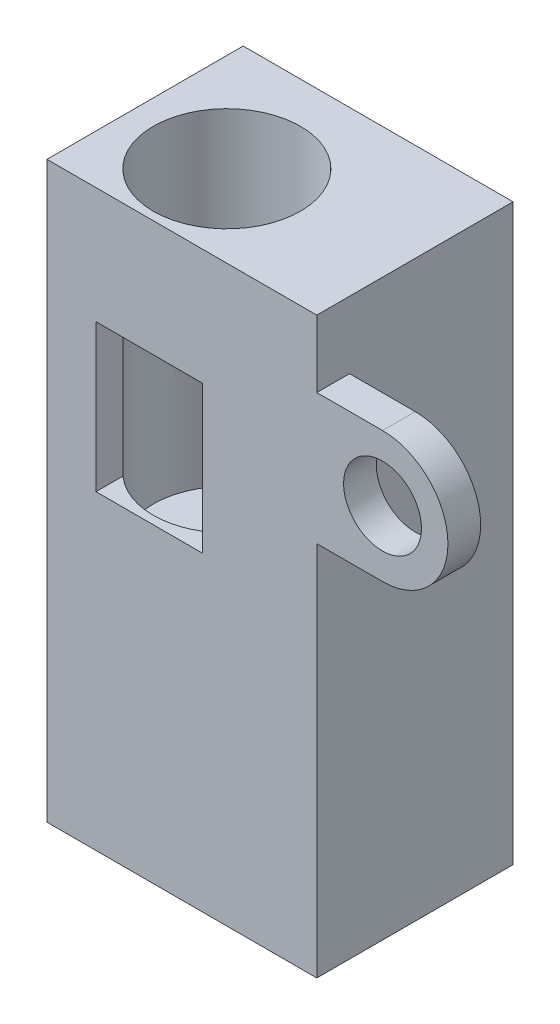
ISO-10303-21;
HEADER;
FILE_DESCRIPTION(('STEP AP214'),'2;1');
FILE_NAME('part.step','',(''),(''),'','','');
FILE_SCHEMA(('AUTOMOTIVE_DESIGN { 1 0 10303 214 1 1 1 1 }'));
ENDSEC;
DATA;
#1=APPLICATION_CONTEXT('core data for automotive mechanical design processes');
#2=APPLICATION_PROTOCOL_DEFINITION('international standard','automotive_design',2000,#1);
#3=PRODUCT_CONTEXT('',#1,'mechanical');
#4=PRODUCT('Part','Part','',(#3));
#5=PRODUCT_RELATED_PRODUCT_CATEGORY('part','',(#4));
#6=PRODUCT_DEFINITION_FORMATION('','',#4);
#7=PRODUCT_DEFINITION_CONTEXT('part definition',#1,'design');
#8=PRODUCT_DEFINITION('design','',#6,#7);
#9=PRODUCT_DEFINITION_SHAPE('','',#8);
#10=(LENGTH_UNIT() NAMED_UNIT(*) SI_UNIT(.MILLI.,.METRE.));
#11=(NAMED_UNIT(*) PLANE_ANGLE_UNIT() SI_UNIT($,.RADIAN.));
#12=(NAMED_UNIT(*) SI_UNIT($,.STERADIAN.) SOLID_ANGLE_UNIT());
#13=UNCERTAINTY_MEASURE_WITH_UNIT(LENGTH_MEASURE(1.E-05),#10,'distance_accuracy_value','');
#14=(GEOMETRIC_REPRESENTATION_CONTEXT(3) GLOBAL_UNCERTAINTY_ASSIGNED_CONTEXT((#13)) GLOBAL_UNIT_ASSIGNED_CONTEXT((#10,
#11,#12)) REPRESENTATION_CONTEXT('',''));
#15=CARTESIAN_POINT('',(0.,0.,0.));
#16=DIRECTION('',(0.,0.,1.));
#17=DIRECTION('',(1.,0.,0.));
#18=AXIS2_PLACEMENT_3D('',#15,#16,#17);
#19=CARTESIAN_POINT('',(16.5,0.,0.));
#20=DIRECTION('',(0.,0.,-1.));
#21=DIRECTION('',(-1.,0.,0.));
#22=AXIS2_PLACEMENT_3D('',#19,#20,#21);
#23=PLANE('',#22);
#24=DIRECTION('',(-1.,0.,0.));
#25=VECTOR('',#24,1.);
#26=CARTESIAN_POINT('',(16.5,37.1,0.));
#27=LINE('',#26,#25);
#28=CARTESIAN_POINT('',(16.5,37.1,0.));
#29=VERTEX_POINT('',#28);
#30=CARTESIAN_POINT('',(0.,37.1,0.));
#31=VERTEX_POINT('',#30);
#32=EDGE_CURVE('E263',#29,#31,#27,.T.);
#33=ORIENTED_EDGE('',*,*,#32,.T.);
#34=DIRECTION('',(0.,-1.,0.));
#35=VECTOR('',#34,1.);
#36=CARTESIAN_POINT('',(0.,0.,0.));
#37=LINE('',#36,#35);
#38=CARTESIAN_POINT('',(0.,2.,0.));
#39=VERTEX_POINT('',#38);
#40=EDGE_CURVE('E258',#31,#39,#37,.T.);
#41=ORIENTED_EDGE('',*,*,#40,.T.);
#42=DIRECTION('',(1.,0.,0.));
#43=VECTOR('',#42,1.);
#44=CARTESIAN_POINT('',(0.,2.,0.));
#45=LINE('',#44,#43);
#46=CARTESIAN_POINT('',(16.5,2.,0.));
#47=VERTEX_POINT('',#46);
#48=EDGE_CURVE('E246',#39,#47,#45,.T.);
#49=ORIENTED_EDGE('',*,*,#48,.T.);
#50=DIRECTION('',(0.,-1.,0.));
#51=VECTOR('',#50,1.);
#52=CARTESIAN_POINT('',(16.5,0.,0.));
#53=LINE('',#52,#51);
#54=CARTESIAN_POINT('',(16.5,25.,0.));
#55=VERTEX_POINT('',#54);
#56=EDGE_CURVE('E257',#55,#47,#53,.T.);
#57=ORIENTED_EDGE('',*,*,#56,.F.);
#58=DIRECTION('',(1.,0.,0.));
#59=VECTOR('',#58,1.);
#60=CARTESIAN_POINT('',(0.,25.,0.));
#61=LINE('',#60,#59);
#62=CARTESIAN_POINT('',(20.5182193377738,25.,0.));
#63=VERTEX_POINT('',#62);
#64=EDGE_CURVE('E203',#55,#63,#61,.T.);
#65=ORIENTED_EDGE('',*,*,#64,.T.);
#66=CARTESIAN_POINT('',(20.5182193377738,29.,0.));
#67=DIRECTION('',(0.,0.,1.));
#68=DIRECTION('',(1.,0.,0.));
#69=AXIS2_PLACEMENT_3D('',#66,#67,#68);
#70=CIRCLE('',#69,4.);
#71=CARTESIAN_POINT('',(20.5182193377738,33.,0.));
#72=VERTEX_POINT('',#71);
#73=EDGE_CURVE('E198',#72,#63,#70,.F.);
#74=ORIENTED_EDGE('',*,*,#73,.F.);
#75=DIRECTION('',(-1.,0.,0.));
#76=VECTOR('',#75,1.);
#77=CARTESIAN_POINT('',(0.,33.,0.));
#78=LINE('',#77,#76);
#79=CARTESIAN_POINT('',(16.5,33.,0.));
#80=VERTEX_POINT('',#79);
#81=EDGE_CURVE('E218',#72,#80,#78,.T.);
#82=ORIENTED_EDGE('',*,*,#81,.T.);
#83=EDGE_CURVE('E259',#29,#80,#53,.T.);
#84=ORIENTED_EDGE('',*,*,#83,.F.);
#85=EDGE_LOOP('',(#33,#41,#49,#57,#65,#74,#82,#84));
#86=FACE_BOUND('',#85,.T.);
#87=CARTESIAN_POINT('',(20.5182193377738,29.,0.));
#88=DIRECTION('',(0.,0.,-1.));
#89=DIRECTION('',(-1.,0.,0.));
#90=AXIS2_PLACEMENT_3D('',#87,#88,#89);
#91=CIRCLE('',#90,2.38125);
#92=CARTESIAN_POINT('',(18.1369693377738,29.,0.));
#93=VERTEX_POINT('',#92);
#94=EDGE_CURVE('E194',#93,#93,#91,.T.);
#95=ORIENTED_EDGE('',*,*,#94,.T.);
#96=EDGE_LOOP('',(#95));
#97=FACE_BOUND('',#96,.T.);
#98=DIRECTION('',(0.,-1.,0.));
#99=VECTOR('',#98,1.);
#100=CARTESIAN_POINT('',(9.5,0.,0.));
#101=LINE('',#100,#99);
#102=CARTESIAN_POINT('',(9.5,30.,0.));
#103=VERTEX_POINT('',#102);
#104=CARTESIAN_POINT('',(9.5,21.,0.));
#105=VERTEX_POINT('',#104);
#106=EDGE_CURVE('E57',#103,#105,#101,.T.);
#107=ORIENTED_EDGE('',*,*,#106,.T.);
#108=DIRECTION('',(-1.,0.,0.));
#109=VECTOR('',#108,1.);
#110=CARTESIAN_POINT('',(0.,21.,0.));
#111=LINE('',#110,#109);
#112=CARTESIAN_POINT('',(3.,21.,0.));
#113=VERTEX_POINT('',#112);
#114=EDGE_CURVE('E149',#105,#113,#111,.T.);
#115=ORIENTED_EDGE('',*,*,#114,.T.);
#116=DIRECTION('',(0.,1.,0.));
#117=VECTOR('',#116,1.);
#118=CARTESIAN_POINT('',(3.,0.,0.));
#119=LINE('',#118,#117);
#120=CARTESIAN_POINT('',(3.,30.,0.));
#121=VERTEX_POINT('',#120);
#122=EDGE_CURVE('E133',#113,#121,#119,.T.);
#123=ORIENTED_EDGE('',*,*,#122,.T.);
#124=DIRECTION('',(1.,0.,0.));
#125=VECTOR('',#124,1.);
#126=CARTESIAN_POINT('',(0.,30.,0.));
#127=LINE('',#126,#125);
#128=EDGE_CURVE('E143',#121,#103,#127,.T.);
#129=ORIENTED_EDGE('',*,*,#128,.T.);
#130=EDGE_LOOP('',(#107,#115,#123,#129));
#131=FACE_BOUND('',#130,.T.);
#132=ADVANCED_FACE('F41',(#86,#97,#131),#23,.F.);
#133=CARTESIAN_POINT('',(6.,17.1,-5.));
#134=DIRECTION('',(0.,1.,0.));
#135=DIRECTION('',(0.,0.,1.));
#136=AXIS2_PLACEMENT_3D('',#133,#134,#135);
#137=CYLINDRICAL_SURFACE('',#136,4.5);
#138=CARTESIAN_POINT('',(6.,37.1,-5.));
#139=DIRECTION('',(0.,1.,0.));
#140=DIRECTION('',(0.,0.,1.));
#141=AXIS2_PLACEMENT_3D('',#138,#139,#140);
#142=CIRCLE('',#141,4.5);
#143=CARTESIAN_POINT('',(6.,37.1,-0.500000000000001));
#144=VERTEX_POINT('',#143);
#145=EDGE_CURVE('E159',#144,#144,#142,.T.);
#146=ORIENTED_EDGE('',*,*,#145,.T.);
#147=EDGE_LOOP('',(#146));
#148=FACE_BOUND('',#147,.T.);
#149=CARTESIAN_POINT('',(6.,17.1,-5.));
#150=DIRECTION('',(0.,1.,0.));
#151=DIRECTION('',(0.,0.,1.));
#152=AXIS2_PLACEMENT_3D('',#149,#150,#151);
#153=CIRCLE('',#152,4.5);
#154=CARTESIAN_POINT('',(6.,17.1,-0.500000000000001));
#155=VERTEX_POINT('',#154);
#156=EDGE_CURVE('E164',#155,#155,#153,.T.);
#157=ORIENTED_EDGE('',*,*,#156,.F.);
#158=EDGE_LOOP('',(#157));
#159=FACE_BOUND('',#158,.T.);
#160=DIRECTION('',(0.,1.,0.));
#161=VECTOR('',#160,1.);
#162=CARTESIAN_POINT('',(9.5,17.1,-2.17157287525381));
#163=LINE('',#162,#161);
#164=CARTESIAN_POINT('',(9.5,30.,-2.17157287525381));
#165=VERTEX_POINT('',#164);
#166=CARTESIAN_POINT('',(9.5,21.,-2.17157287525381));
#167=VERTEX_POINT('',#166);
#168=EDGE_CURVE('E11',#165,#167,#163,.F.);
#169=ORIENTED_EDGE('',*,*,#168,.F.);
#170=CARTESIAN_POINT('',(6.,30.,-5.));
#171=DIRECTION('',(0.,-1.,0.));
#172=DIRECTION('',(0.,0.,-1.));
#173=AXIS2_PLACEMENT_3D('',#170,#171,#172);
#174=CIRCLE('',#173,4.5);
#175=CARTESIAN_POINT('',(3.,30.,-1.64589803375032));
#176=VERTEX_POINT('',#175);
#177=EDGE_CURVE('E271',#176,#165,#174,.F.);
#178=ORIENTED_EDGE('',*,*,#177,.F.);
#179=DIRECTION('',(0.,1.,0.));
#180=VECTOR('',#179,1.);
#181=CARTESIAN_POINT('',(3.,17.1,-1.64589803375032));
#182=LINE('',#181,#180);
#183=CARTESIAN_POINT('',(3.,21.,-1.64589803375032));
#184=VERTEX_POINT('',#183);
#185=EDGE_CURVE('E136',#184,#176,#182,.T.);
#186=ORIENTED_EDGE('',*,*,#185,.F.);
#187=CARTESIAN_POINT('',(6.,21.,-5.));
#188=DIRECTION('',(0.,1.,0.));
#189=DIRECTION('',(0.,0.,1.));
#190=AXIS2_PLACEMENT_3D('',#187,#188,#189);
#191=CIRCLE('',#190,4.5);
#192=EDGE_CURVE('E50',#167,#184,#191,.F.);
#193=ORIENTED_EDGE('',*,*,#192,.F.);
#194=EDGE_LOOP('',(#169,#178,#186,#193));
#195=FACE_BOUND('',#194,.T.);
#196=ADVANCED_FACE('F282',(#148,#159,#195),#137,.F.);
#197=CARTESIAN_POINT('',(16.5,0.,-12.));
#198=DIRECTION('',(0.,0.,1.));
#199=DIRECTION('',(1.,0.,0.));
#200=AXIS2_PLACEMENT_3D('',#197,#198,#199);
#201=PLANE('',#200);
#202=DIRECTION('',(0.,1.,0.));
#203=VECTOR('',#202,1.);
#204=CARTESIAN_POINT('',(0.,0.,-12.));
#205=LINE('',#204,#203);
#206=CARTESIAN_POINT('',(0.,2.,-12.));
#207=VERTEX_POINT('',#206);
#208=CARTESIAN_POINT('',(0.,37.1,-12.));
#209=VERTEX_POINT('',#208);
#210=EDGE_CURVE('E250',#207,#209,#205,.T.);
#211=ORIENTED_EDGE('',*,*,#210,.T.);
#212=DIRECTION('',(1.,0.,0.));
#213=VECTOR('',#212,1.);
#214=CARTESIAN_POINT('',(0.,37.1,-12.));
#215=LINE('',#214,#213);
#216=CARTESIAN_POINT('',(16.5,37.1,-12.));
#217=VERTEX_POINT('',#216);
#218=EDGE_CURVE('E184',#209,#217,#215,.T.);
#219=ORIENTED_EDGE('',*,*,#218,.T.);
#220=DIRECTION('',(0.,1.,0.));
#221=VECTOR('',#220,1.);
#222=CARTESIAN_POINT('',(16.5,0.,-12.));
#223=LINE('',#222,#221);
#224=CARTESIAN_POINT('',(16.5,2.,-12.));
#225=VERTEX_POINT('',#224);
#226=EDGE_CURVE('E253',#225,#217,#223,.T.);
#227=ORIENTED_EDGE('',*,*,#226,.F.);
#228=DIRECTION('',(1.,0.,0.));
#229=VECTOR('',#228,1.);
#230=CARTESIAN_POINT('',(0.,2.,-12.));
#231=LINE('',#230,#229);
#232=EDGE_CURVE('E242',#207,#225,#231,.T.);
#233=ORIENTED_EDGE('',*,*,#232,.F.);
#234=EDGE_LOOP('',(#211,#219,#227,#233));
#235=FACE_BOUND('',#234,.T.);
#236=ADVANCED_FACE('F43',(#235),#201,.F.);
#237=CARTESIAN_POINT('',(16.5,0.,0.));
#238=DIRECTION('',(1.,0.,0.));
#239=DIRECTION('',(0.,0.,-1.));
#240=AXIS2_PLACEMENT_3D('',#237,#238,#239);
#241=PLANE('',#240);
#242=DIRECTION('',(0.,0.,-1.));
#243=VECTOR('',#242,1.);
#244=CARTESIAN_POINT('',(16.5,37.1,0.));
#245=LINE('',#244,#243);
#246=EDGE_CURVE('E176',#29,#217,#245,.T.);
#247=ORIENTED_EDGE('',*,*,#246,.F.);
#248=ORIENTED_EDGE('',*,*,#83,.T.);
#249=DIRECTION('',(0.,0.,1.));
#250=VECTOR('',#249,1.);
#251=CARTESIAN_POINT('',(16.5,33.,-2.));
#252=LINE('',#251,#250);
#253=CARTESIAN_POINT('',(16.5,33.,-2.));
#254=VERTEX_POINT('',#253);
#255=EDGE_CURVE('E233',#254,#80,#252,.T.);
#256=ORIENTED_EDGE('',*,*,#255,.F.);
#257=DIRECTION('',(0.,1.,0.));
#258=VECTOR('',#257,1.);
#259=CARTESIAN_POINT('',(16.5,0.,-2.));
#260=LINE('',#259,#258);
#261=CARTESIAN_POINT('',(16.5,25.,-2.));
#262=VERTEX_POINT('',#261);
#263=EDGE_CURVE('E207',#262,#254,#260,.T.);
#264=ORIENTED_EDGE('',*,*,#263,.F.);
#265=DIRECTION('',(0.,0.,1.));
#266=VECTOR('',#265,1.);
#267=CARTESIAN_POINT('',(16.5,25.,-2.));
#268=LINE('',#267,#266);
#269=EDGE_CURVE('E229',#262,#55,#268,.T.);
#270=ORIENTED_EDGE('',*,*,#269,.T.);
#271=ORIENTED_EDGE('',*,*,#56,.T.);
#272=DIRECTION('',(0.,0.,1.));
#273=VECTOR('',#272,1.);
#274=CARTESIAN_POINT('',(16.5,2.,-12.));
#275=LINE('',#274,#273);
#276=EDGE_CURVE('E228',#225,#47,#275,.T.);
#277=ORIENTED_EDGE('',*,*,#276,.F.);
#278=ORIENTED_EDGE('',*,*,#226,.T.);
#279=EDGE_LOOP('',(#247,#248,#256,#264,#270,#271,#277,#278));
#280=FACE_BOUND('',#279,.T.);
#281=ADVANCED_FACE('F310',(#280),#241,.T.);
#282=CARTESIAN_POINT('',(0.,0.,0.));
#283=DIRECTION('',(1.,0.,0.));
#284=DIRECTION('',(0.,0.,-1.));
#285=AXIS2_PLACEMENT_3D('',#282,#283,#284);
#286=PLANE('',#285);
#287=ORIENTED_EDGE('',*,*,#40,.F.);
#288=DIRECTION('',(0.,0.,-1.));
#289=VECTOR('',#288,1.);
#290=CARTESIAN_POINT('',(0.,37.1,0.));
#291=LINE('',#290,#289);
#292=EDGE_CURVE('E180',#31,#209,#291,.T.);
#293=ORIENTED_EDGE('',*,*,#292,.T.);
#294=ORIENTED_EDGE('',*,*,#210,.F.);
#295=DIRECTION('',(0.,0.,1.));
#296=VECTOR('',#295,1.);
#297=CARTESIAN_POINT('',(0.,2.,-12.));
#298=LINE('',#297,#296);
#299=EDGE_CURVE('E238',#207,#39,#298,.T.);
#300=ORIENTED_EDGE('',*,*,#299,.T.);
#301=EDGE_LOOP('',(#287,#293,#294,#300));
#302=FACE_BOUND('',#301,.T.);
#303=ADVANCED_FACE('F306',(#302),#286,.F.);
#304=CARTESIAN_POINT('',(0.,2.,-12.));
#305=DIRECTION('',(0.,1.,0.));
#306=DIRECTION('',(0.,0.,1.));
#307=AXIS2_PLACEMENT_3D('',#304,#305,#306);
#308=PLANE('',#307);
#309=CARTESIAN_POINT('',(8.25,2.,-6.));
#310=DIRECTION('',(0.,-1.,0.));
#311=DIRECTION('',(0.,0.,-1.));
#312=AXIS2_PLACEMENT_3D('',#309,#310,#311);
#313=CIRCLE('',#312,2.38125);
#314=CARTESIAN_POINT('',(8.25,2.,-8.38125));
#315=VERTEX_POINT('',#314);
#316=EDGE_CURVE('E168',#315,#315,#313,.T.);
#317=ORIENTED_EDGE('',*,*,#316,.F.);
#318=EDGE_LOOP('',(#317));
#319=FACE_BOUND('',#318,.T.);
#320=ORIENTED_EDGE('',*,*,#276,.T.);
#321=ORIENTED_EDGE('',*,*,#48,.F.);
#322=ORIENTED_EDGE('',*,*,#299,.F.);
#323=ORIENTED_EDGE('',*,*,#232,.T.);
#324=EDGE_LOOP('',(#320,#321,#322,#323));
#325=FACE_BOUND('',#324,.T.);
#326=ADVANCED_FACE('F309',(#319,#325),#308,.F.);
#327=CARTESIAN_POINT('',(20.5182193377738,29.,-2.));
#328=DIRECTION('',(0.,0.,1.));
#329=DIRECTION('',(1.,0.,0.));
#330=AXIS2_PLACEMENT_3D('',#327,#328,#329);
#331=CYLINDRICAL_SURFACE('',#330,4.);
#332=ORIENTED_EDGE('',*,*,#73,.T.);
#333=DIRECTION('',(0.,0.,1.));
#334=VECTOR('',#333,1.);
#335=CARTESIAN_POINT('',(20.5182193377738,25.,-2.));
#336=LINE('',#335,#334);
#337=CARTESIAN_POINT('',(20.5182193377738,25.,-2.));
#338=VERTEX_POINT('',#337);
#339=EDGE_CURVE('E225',#338,#63,#336,.T.);
#340=ORIENTED_EDGE('',*,*,#339,.F.);
#341=CARTESIAN_POINT('',(20.5182193377738,29.,-2.));
#342=DIRECTION('',(0.,0.,1.));
#343=DIRECTION('',(1.,0.,0.));
#344=AXIS2_PLACEMENT_3D('',#341,#342,#343);
#345=CIRCLE('',#344,4.);
#346=CARTESIAN_POINT('',(20.5182193377738,33.,-2.));
#347=VERTEX_POINT('',#346);
#348=EDGE_CURVE('E199',#347,#338,#345,.F.);
#349=ORIENTED_EDGE('',*,*,#348,.F.);
#350=DIRECTION('',(0.,0.,1.));
#351=VECTOR('',#350,1.);
#352=CARTESIAN_POINT('',(20.5182193377738,33.,-2.));
#353=LINE('',#352,#351);
#354=EDGE_CURVE('E214',#347,#72,#353,.T.);
#355=ORIENTED_EDGE('',*,*,#354,.T.);
#356=EDGE_LOOP('',(#332,#340,#349,#355));
#357=FACE_BOUND('',#356,.T.);
#358=ADVANCED_FACE('F317',(#357),#331,.T.);
#359=CARTESIAN_POINT('',(0.,25.,-2.));
#360=DIRECTION('',(0.,-1.,0.));
#361=DIRECTION('',(1.,0.,0.));
#362=AXIS2_PLACEMENT_3D('',#359,#360,#361);
#363=PLANE('',#362);
#364=ORIENTED_EDGE('',*,*,#64,.F.);
#365=ORIENTED_EDGE('',*,*,#269,.F.);
#366=DIRECTION('',(1.,0.,0.));
#367=VECTOR('',#366,1.);
#368=CARTESIAN_POINT('',(0.,25.,-2.));
#369=LINE('',#368,#367);
#370=EDGE_CURVE('E210',#262,#338,#369,.T.);
#371=ORIENTED_EDGE('',*,*,#370,.T.);
#372=ORIENTED_EDGE('',*,*,#339,.T.);
#373=EDGE_LOOP('',(#364,#365,#371,#372));
#374=FACE_BOUND('',#373,.T.);
#375=ADVANCED_FACE('F321',(#374),#363,.T.);
#376=CARTESIAN_POINT('',(0.,33.,-2.));
#377=DIRECTION('',(0.,1.,0.));
#378=DIRECTION('',(0.,0.,1.));
#379=AXIS2_PLACEMENT_3D('',#376,#377,#378);
#380=PLANE('',#379);
#381=ORIENTED_EDGE('',*,*,#81,.F.);
#382=ORIENTED_EDGE('',*,*,#354,.F.);
#383=DIRECTION('',(-1.,0.,0.));
#384=VECTOR('',#383,1.);
#385=CARTESIAN_POINT('',(0.,33.,-2.));
#386=LINE('',#385,#384);
#387=EDGE_CURVE('E202',#347,#254,#386,.T.);
#388=ORIENTED_EDGE('',*,*,#387,.T.);
#389=ORIENTED_EDGE('',*,*,#255,.T.);
#390=EDGE_LOOP('',(#381,#382,#388,#389));
#391=FACE_BOUND('',#390,.T.);
#392=ADVANCED_FACE('F323',(#391),#380,.T.);
#393=CARTESIAN_POINT('',(0.,0.,-2.));
#394=DIRECTION('',(0.,0.,1.));
#395=DIRECTION('',(1.,0.,0.));
#396=AXIS2_PLACEMENT_3D('',#393,#394,#395);
#397=PLANE('',#396);
#398=CARTESIAN_POINT('',(20.5182193377738,29.,-2.));
#399=DIRECTION('',(0.,0.,-1.));
#400=DIRECTION('',(-1.,0.,0.));
#401=AXIS2_PLACEMENT_3D('',#398,#399,#400);
#402=CIRCLE('',#401,2.38125);
#403=CARTESIAN_POINT('',(18.1369693377738,29.,-2.));
#404=VERTEX_POINT('',#403);
#405=EDGE_CURVE('E190',#404,#404,#402,.T.);
#406=ORIENTED_EDGE('',*,*,#405,.F.);
#407=EDGE_LOOP('',(#406));
#408=FACE_BOUND('',#407,.T.);
#409=ORIENTED_EDGE('',*,*,#348,.T.);
#410=ORIENTED_EDGE('',*,*,#370,.F.);
#411=ORIENTED_EDGE('',*,*,#263,.T.);
#412=ORIENTED_EDGE('',*,*,#387,.F.);
#413=EDGE_LOOP('',(#409,#410,#411,#412));
#414=FACE_BOUND('',#413,.T.);
#415=ADVANCED_FACE('F326',(#408,#414),#397,.F.);
#416=CARTESIAN_POINT('',(20.5182193377738,29.,10.6066017177982));
#417=DIRECTION('',(0.,0.,-1.));
#418=DIRECTION('',(-1.,0.,0.));
#419=AXIS2_PLACEMENT_3D('',#416,#417,#418);
#420=CYLINDRICAL_SURFACE('',#419,2.38125);
#421=ORIENTED_EDGE('',*,*,#405,.T.);
#422=EDGE_LOOP('',(#421));
#423=FACE_BOUND('',#422,.T.);
#424=ORIENTED_EDGE('',*,*,#94,.F.);
#425=EDGE_LOOP('',(#424));
#426=FACE_BOUND('',#425,.T.);
#427=ADVANCED_FACE('F333',(#423,#426),#420,.F.);
#428=CARTESIAN_POINT('',(0.,37.1,0.));
#429=DIRECTION('',(0.,-1.,0.));
#430=DIRECTION('',(0.,0.,-1.));
#431=AXIS2_PLACEMENT_3D('',#428,#429,#430);
#432=PLANE('',#431);
#433=ORIENTED_EDGE('',*,*,#145,.F.);
#434=EDGE_LOOP('',(#433));
#435=FACE_BOUND('',#434,.T.);
#436=ORIENTED_EDGE('',*,*,#246,.T.);
#437=ORIENTED_EDGE('',*,*,#218,.F.);
#438=ORIENTED_EDGE('',*,*,#292,.F.);
#439=ORIENTED_EDGE('',*,*,#32,.F.);
#440=EDGE_LOOP('',(#436,#437,#438,#439));
#441=FACE_BOUND('',#440,.T.);
#442=ADVANCED_FACE('F337',(#435,#441),#432,.F.);
#443=CARTESIAN_POINT('',(8.25,8.35,-6.));
#444=DIRECTION('',(0.,-1.,0.));
#445=DIRECTION('',(0.,0.,-1.));
#446=AXIS2_PLACEMENT_3D('',#443,#444,#445);
#447=CYLINDRICAL_SURFACE('',#446,2.38125);
#448=CARTESIAN_POINT('',(8.25,8.35,-6.));
#449=DIRECTION('',(0.,-1.,0.));
#450=DIRECTION('',(0.,0.,-1.));
#451=AXIS2_PLACEMENT_3D('',#448,#449,#450);
#452=CIRCLE('',#451,2.38125);
#453=CARTESIAN_POINT('',(8.25,8.35,-8.38125));
#454=VERTEX_POINT('',#453);
#455=EDGE_CURVE('E172',#454,#454,#452,.T.);
#456=ORIENTED_EDGE('',*,*,#455,.F.);
#457=EDGE_LOOP('',(#456));
#458=FACE_BOUND('',#457,.T.);
#459=ORIENTED_EDGE('',*,*,#316,.T.);
#460=EDGE_LOOP('',(#459));
#461=FACE_BOUND('',#460,.T.);
#462=ADVANCED_FACE('F341',(#458,#461),#447,.F.);
#463=CARTESIAN_POINT('',(0.,8.35,0.));
#464=DIRECTION('',(0.,-1.,0.));
#465=DIRECTION('',(0.,0.,-1.));
#466=AXIS2_PLACEMENT_3D('',#463,#464,#465);
#467=PLANE('',#466);
#468=ORIENTED_EDGE('',*,*,#455,.T.);
#469=EDGE_LOOP('',(#468));
#470=FACE_BOUND('',#469,.T.);
#471=ADVANCED_FACE('F293',(#470),#467,.T.);
#472=CARTESIAN_POINT('',(0.,17.1,0.));
#473=DIRECTION('',(0.,1.,0.));
#474=DIRECTION('',(0.,0.,1.));
#475=AXIS2_PLACEMENT_3D('',#472,#473,#474);
#476=PLANE('',#475);
#477=ORIENTED_EDGE('',*,*,#156,.T.);
#478=EDGE_LOOP('',(#477));
#479=FACE_BOUND('',#478,.T.);
#480=ADVANCED_FACE('F286',(#479),#476,.T.);
#481=CARTESIAN_POINT('',(9.5,0.,-6.));
#482=DIRECTION('',(-1.,0.,0.));
#483=DIRECTION('',(0.,0.,1.));
#484=AXIS2_PLACEMENT_3D('',#481,#482,#483);
#485=PLANE('',#484);
#486=ORIENTED_EDGE('',*,*,#168,.T.);
#487=DIRECTION('',(0.,0.,1.));
#488=VECTOR('',#487,1.);
#489=CARTESIAN_POINT('',(9.5,21.,-6.));
#490=LINE('',#489,#488);
#491=EDGE_CURVE('E156',#167,#105,#490,.T.);
#492=ORIENTED_EDGE('',*,*,#491,.T.);
#493=ORIENTED_EDGE('',*,*,#106,.F.);
#494=DIRECTION('',(0.,0.,1.));
#495=VECTOR('',#494,1.);
#496=CARTESIAN_POINT('',(9.5,30.,-6.));
#497=LINE('',#496,#495);
#498=EDGE_CURVE('E140',#165,#103,#497,.T.);
#499=ORIENTED_EDGE('',*,*,#498,.F.);
#500=EDGE_LOOP('',(#486,#492,#493,#499));
#501=FACE_BOUND('',#500,.T.);
#502=ADVANCED_FACE('F283',(#501),#485,.T.);
#503=CARTESIAN_POINT('',(0.,21.,-6.));
#504=DIRECTION('',(0.,1.,0.));
#505=DIRECTION('',(0.,0.,1.));
#506=AXIS2_PLACEMENT_3D('',#503,#504,#505);
#507=PLANE('',#506);
#508=ORIENTED_EDGE('',*,*,#192,.T.);
#509=DIRECTION('',(0.,0.,1.));
#510=VECTOR('',#509,1.);
#511=CARTESIAN_POINT('',(3.,21.,-6.));
#512=LINE('',#511,#510);
#513=EDGE_CURVE('E139',#184,#113,#512,.T.);
#514=ORIENTED_EDGE('',*,*,#513,.T.);
#515=ORIENTED_EDGE('',*,*,#114,.F.);
#516=ORIENTED_EDGE('',*,*,#491,.F.);
#517=EDGE_LOOP('',(#508,#514,#515,#516));
#518=FACE_BOUND('',#517,.T.);
#519=ADVANCED_FACE('F279',(#518),#507,.T.);
#520=CARTESIAN_POINT('',(3.,0.,-6.));
#521=DIRECTION('',(1.,0.,0.));
#522=DIRECTION('',(0.,0.,-1.));
#523=AXIS2_PLACEMENT_3D('',#520,#521,#522);
#524=PLANE('',#523);
#525=ORIENTED_EDGE('',*,*,#185,.T.);
#526=DIRECTION('',(0.,0.,1.));
#527=VECTOR('',#526,1.);
#528=CARTESIAN_POINT('',(3.,30.,-6.));
#529=LINE('',#528,#527);
#530=EDGE_CURVE('E65',#176,#121,#529,.T.);
#531=ORIENTED_EDGE('',*,*,#530,.T.);
#532=ORIENTED_EDGE('',*,*,#122,.F.);
#533=ORIENTED_EDGE('',*,*,#513,.F.);
#534=EDGE_LOOP('',(#525,#531,#532,#533));
#535=FACE_BOUND('',#534,.T.);
#536=ADVANCED_FACE('F130',(#535),#524,.T.);
#537=CARTESIAN_POINT('',(0.,30.,-6.));
#538=DIRECTION('',(0.,-1.,0.));
#539=DIRECTION('',(0.,0.,-1.));
#540=AXIS2_PLACEMENT_3D('',#537,#538,#539);
#541=PLANE('',#540);
#542=ORIENTED_EDGE('',*,*,#177,.T.);
#543=ORIENTED_EDGE('',*,*,#498,.T.);
#544=ORIENTED_EDGE('',*,*,#128,.F.);
#545=ORIENTED_EDGE('',*,*,#530,.F.);
#546=EDGE_LOOP('',(#542,#543,#544,#545));
#547=FACE_BOUND('',#546,.T.);
#548=ADVANCED_FACE('F144',(#547),#541,.T.);
#549=CLOSED_SHELL('',(#132,#196,#236,#281,#303,#326,#358,#375,#392,#415,#427,#442,#462,#471,
#480,#502,#519,#536,#548));
#550=MANIFOLD_SOLID_BREP('B2',#549);
#551=ADVANCED_BREP_SHAPE_REPRESENTATION('',(#18,#550),#14);
#552=SHAPE_DEFINITION_REPRESENTATION(#9,#551);
ENDSEC;
END-ISO-10303-21;
